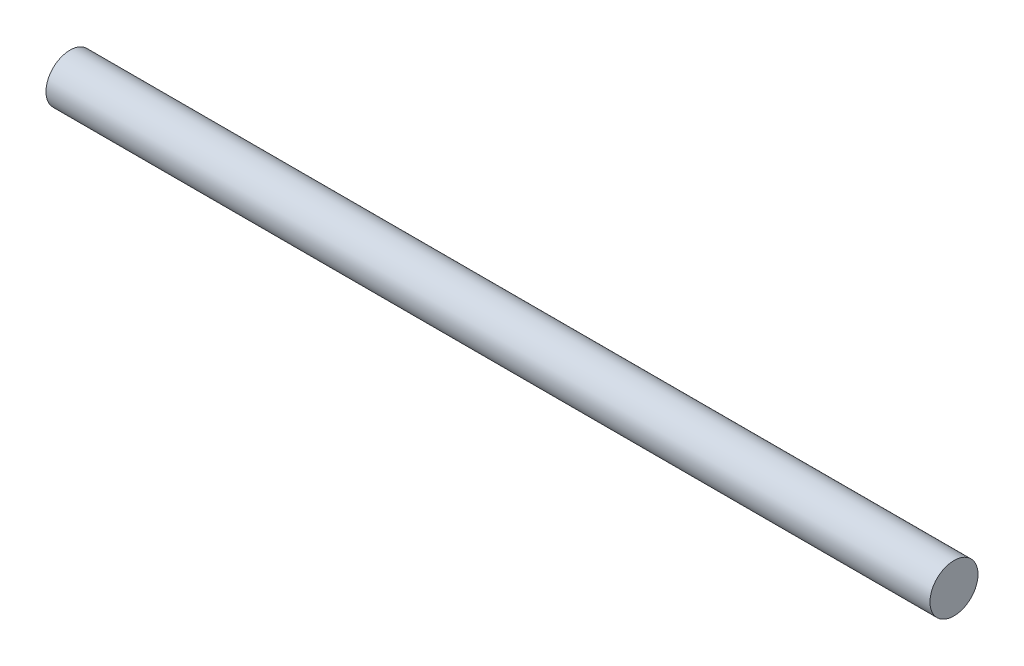
ISO-10303-21;
HEADER;
FILE_DESCRIPTION(('STEP AP214'),'2;1');
FILE_NAME('part.step','',(''),(''),'','','');
FILE_SCHEMA(('AUTOMOTIVE_DESIGN { 1 0 10303 214 1 1 1 1 }'));
ENDSEC;
DATA;
#1=APPLICATION_CONTEXT('core data for automotive mechanical design processes');
#2=APPLICATION_PROTOCOL_DEFINITION('international standard','automotive_design',2000,#1);
#3=PRODUCT_CONTEXT('',#1,'mechanical');
#4=PRODUCT('Part','Part','',(#3));
#5=PRODUCT_RELATED_PRODUCT_CATEGORY('part','',(#4));
#6=PRODUCT_DEFINITION_FORMATION('','',#4);
#7=PRODUCT_DEFINITION_CONTEXT('part definition',#1,'design');
#8=PRODUCT_DEFINITION('design','',#6,#7);
#9=PRODUCT_DEFINITION_SHAPE('','',#8);
#10=(LENGTH_UNIT() NAMED_UNIT(*) SI_UNIT(.MILLI.,.METRE.));
#11=(NAMED_UNIT(*) PLANE_ANGLE_UNIT() SI_UNIT($,.RADIAN.));
#12=(NAMED_UNIT(*) SI_UNIT($,.STERADIAN.) SOLID_ANGLE_UNIT());
#13=UNCERTAINTY_MEASURE_WITH_UNIT(LENGTH_MEASURE(1.E-05),#10,'distance_accuracy_value','');
#14=(GEOMETRIC_REPRESENTATION_CONTEXT(3) GLOBAL_UNCERTAINTY_ASSIGNED_CONTEXT((#13)) GLOBAL_UNIT_ASSIGNED_CONTEXT((#10,
#11,#12)) REPRESENTATION_CONTEXT('',''));
#15=CARTESIAN_POINT('',(0.,0.,0.));
#16=DIRECTION('',(0.,0.,1.));
#17=DIRECTION('',(1.,0.,0.));
#18=AXIS2_PLACEMENT_3D('',#15,#16,#17);
#19=CARTESIAN_POINT('',(233.68,0.,0.));
#20=DIRECTION('',(-1.,0.,0.));
#21=DIRECTION('',(0.,0.,1.));
#22=AXIS2_PLACEMENT_3D('',#19,#20,#21);
#23=CYLINDRICAL_SURFACE('',#22,6.35);
#24=CARTESIAN_POINT('',(233.68,0.,0.));
#25=DIRECTION('',(1.,0.,0.));
#26=DIRECTION('',(0.,0.,-1.));
#27=AXIS2_PLACEMENT_3D('',#24,#25,#26);
#28=CIRCLE('',#27,6.35);
#29=CARTESIAN_POINT('',(233.68,0.,-6.35));
#30=VERTEX_POINT('',#29);
#31=EDGE_CURVE('E10',#30,#30,#28,.T.);
#32=ORIENTED_EDGE('',*,*,#31,.F.);
#33=EDGE_LOOP('',(#32));
#34=FACE_BOUND('',#33,.T.);
#35=CARTESIAN_POINT('',(0.,0.,0.));
#36=DIRECTION('',(1.,0.,0.));
#37=DIRECTION('',(0.,0.,-1.));
#38=AXIS2_PLACEMENT_3D('',#35,#36,#37);
#39=CIRCLE('',#38,6.35);
#40=CARTESIAN_POINT('',(0.,0.,-6.35));
#41=VERTEX_POINT('',#40);
#42=EDGE_CURVE('E40',#41,#41,#39,.T.);
#43=ORIENTED_EDGE('',*,*,#42,.T.);
#44=EDGE_LOOP('',(#43));
#45=FACE_BOUND('',#44,.T.);
#46=ADVANCED_FACE('F37',(#34,#45),#23,.T.);
#47=CARTESIAN_POINT('',(233.68,0.,0.));
#48=DIRECTION('',(1.,0.,0.));
#49=DIRECTION('',(0.,0.,-1.));
#50=AXIS2_PLACEMENT_3D('',#47,#48,#49);
#51=PLANE('',#50);
#52=ORIENTED_EDGE('',*,*,#31,.T.);
#53=EDGE_LOOP('',(#52));
#54=FACE_BOUND('',#53,.T.);
#55=ADVANCED_FACE('F54',(#54),#51,.T.);
#56=CARTESIAN_POINT('',(0.,0.,0.));
#57=DIRECTION('',(1.,0.,0.));
#58=DIRECTION('',(0.,0.,-1.));
#59=AXIS2_PLACEMENT_3D('',#56,#57,#58);
#60=PLANE('',#59);
#61=ORIENTED_EDGE('',*,*,#42,.F.);
#62=EDGE_LOOP('',(#61));
#63=FACE_BOUND('',#62,.T.);
#64=ADVANCED_FACE('F52',(#63),#60,.F.);
#65=CLOSED_SHELL('',(#46,#55,#64));
#66=MANIFOLD_SOLID_BREP('B2',#65);
#67=ADVANCED_BREP_SHAPE_REPRESENTATION('',(#18,#66),#14);
#68=SHAPE_DEFINITION_REPRESENTATION(#9,#67);
ENDSEC;
END-ISO-10303-21;
